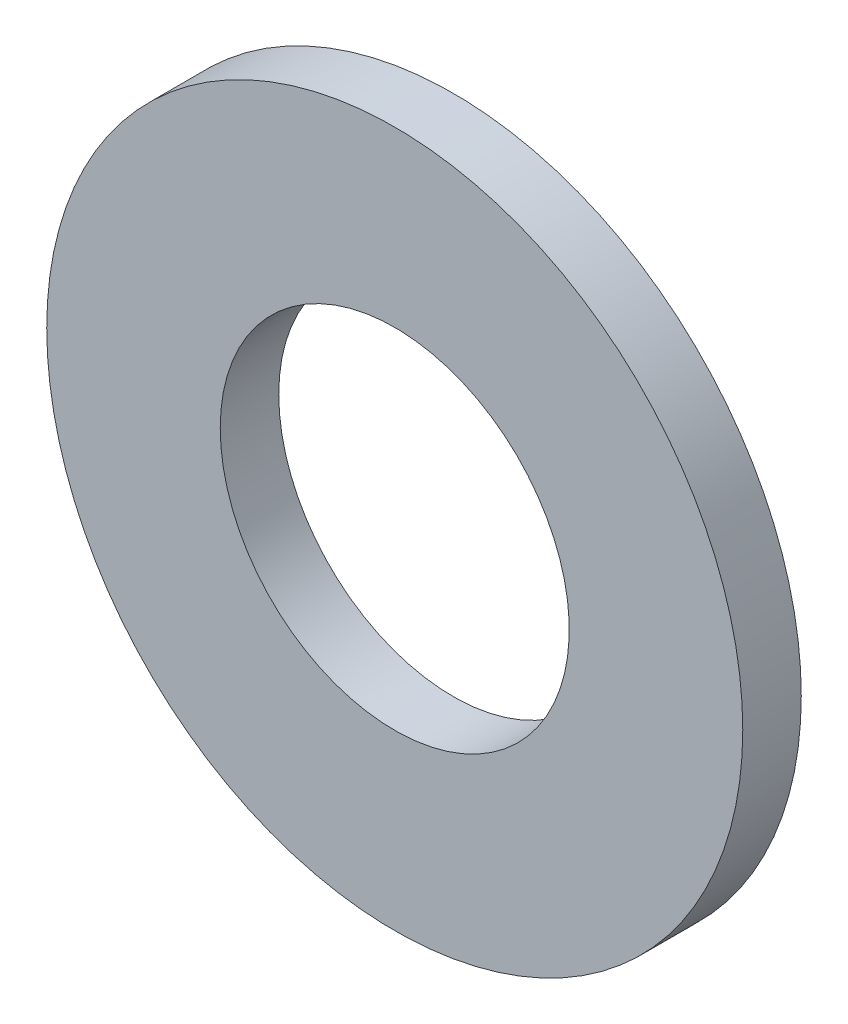
ISO-10303-21;
HEADER;
FILE_DESCRIPTION(('STEP AP214'),'2;1');
FILE_NAME('part.step','',(''),(''),'','','');
FILE_SCHEMA(('AUTOMOTIVE_DESIGN { 1 0 10303 214 1 1 1 1 }'));
ENDSEC;
DATA;
#1=APPLICATION_CONTEXT('core data for automotive mechanical design processes');
#2=APPLICATION_PROTOCOL_DEFINITION('international standard','automotive_design',2000,#1);
#3=PRODUCT_CONTEXT('',#1,'mechanical');
#4=PRODUCT('Part','Part','',(#3));
#5=PRODUCT_RELATED_PRODUCT_CATEGORY('part','',(#4));
#6=PRODUCT_DEFINITION_FORMATION('','',#4);
#7=PRODUCT_DEFINITION_CONTEXT('part definition',#1,'design');
#8=PRODUCT_DEFINITION('design','',#6,#7);
#9=PRODUCT_DEFINITION_SHAPE('','',#8);
#10=(LENGTH_UNIT() NAMED_UNIT(*) SI_UNIT(.MILLI.,.METRE.));
#11=(NAMED_UNIT(*) PLANE_ANGLE_UNIT() SI_UNIT($,.RADIAN.));
#12=(NAMED_UNIT(*) SI_UNIT($,.STERADIAN.) SOLID_ANGLE_UNIT());
#13=UNCERTAINTY_MEASURE_WITH_UNIT(LENGTH_MEASURE(1.E-05),#10,'distance_accuracy_value','');
#14=(GEOMETRIC_REPRESENTATION_CONTEXT(3) GLOBAL_UNCERTAINTY_ASSIGNED_CONTEXT((#13)) GLOBAL_UNIT_ASSIGNED_CONTEXT((#10,
#11,#12)) REPRESENTATION_CONTEXT('',''));
#15=CARTESIAN_POINT('',(0.,0.,0.));
#16=DIRECTION('',(0.,0.,1.));
#17=DIRECTION('',(1.,0.,0.));
#18=AXIS2_PLACEMENT_3D('',#15,#16,#17);
#19=CARTESIAN_POINT('',(0.,0.,0.));
#20=DIRECTION('',(0.,0.,-1.));
#21=DIRECTION('',(-1.,0.,0.));
#22=AXIS2_PLACEMENT_3D('',#19,#20,#21);
#23=PLANE('',#22);
#24=CARTESIAN_POINT('',(0.,0.,0.));
#25=DIRECTION('',(0.,0.,-1.));
#26=DIRECTION('',(-1.,0.,0.));
#27=AXIS2_PLACEMENT_3D('',#24,#25,#26);
#28=CIRCLE('',#27,8.763);
#29=CARTESIAN_POINT('',(-8.763,0.,0.));
#30=VERTEX_POINT('',#29);
#31=EDGE_CURVE('E26',#30,#30,#28,.F.);
#32=ORIENTED_EDGE('',*,*,#31,.F.);
#33=EDGE_LOOP('',(#32));
#34=FACE_BOUND('',#33,.T.);
#35=CARTESIAN_POINT('',(0.,0.,0.));
#36=DIRECTION('',(0.,0.,-1.));
#37=DIRECTION('',(-1.,0.,0.));
#38=AXIS2_PLACEMENT_3D('',#35,#36,#37);
#39=CIRCLE('',#38,4.3942);
#40=CARTESIAN_POINT('',(-4.3942,0.,0.));
#41=VERTEX_POINT('',#40);
#42=EDGE_CURVE('E17',#41,#41,#39,.F.);
#43=ORIENTED_EDGE('',*,*,#42,.T.);
#44=EDGE_LOOP('',(#43));
#45=FACE_BOUND('',#44,.T.);
#46=ADVANCED_FACE('F14',(#34,#45),#23,.T.);
#47=CARTESIAN_POINT('',(0.,0.,1.4732));
#48=DIRECTION('',(0.,0.,-1.));
#49=DIRECTION('',(-1.,0.,0.));
#50=AXIS2_PLACEMENT_3D('',#47,#48,#49);
#51=CYLINDRICAL_SURFACE('',#50,4.3942);
#52=CARTESIAN_POINT('',(0.,0.,1.4732));
#53=DIRECTION('',(0.,0.,-1.));
#54=DIRECTION('',(-1.,0.,0.));
#55=AXIS2_PLACEMENT_3D('',#52,#53,#54);
#56=CIRCLE('',#55,4.3942);
#57=CARTESIAN_POINT('',(-4.3942,0.,1.4732));
#58=VERTEX_POINT('',#57);
#59=EDGE_CURVE('E21',#58,#58,#56,.F.);
#60=ORIENTED_EDGE('',*,*,#59,.T.);
#61=EDGE_LOOP('',(#60));
#62=FACE_BOUND('',#61,.T.);
#63=ORIENTED_EDGE('',*,*,#42,.F.);
#64=EDGE_LOOP('',(#63));
#65=FACE_BOUND('',#64,.T.);
#66=ADVANCED_FACE('F35',(#62,#65),#51,.F.);
#67=CARTESIAN_POINT('',(0.,0.,1.4732));
#68=DIRECTION('',(0.,0.,-1.));
#69=DIRECTION('',(-1.,0.,0.));
#70=AXIS2_PLACEMENT_3D('',#67,#68,#69);
#71=CYLINDRICAL_SURFACE('',#70,8.763);
#72=ORIENTED_EDGE('',*,*,#31,.T.);
#73=EDGE_LOOP('',(#72));
#74=FACE_BOUND('',#73,.T.);
#75=CARTESIAN_POINT('',(0.,0.,1.4732));
#76=DIRECTION('',(0.,0.,-1.));
#77=DIRECTION('',(-1.,0.,0.));
#78=AXIS2_PLACEMENT_3D('',#75,#76,#77);
#79=CIRCLE('',#78,8.763);
#80=CARTESIAN_POINT('',(-8.763,0.,1.4732));
#81=VERTEX_POINT('',#80);
#82=EDGE_CURVE('E10',#81,#81,#79,.T.);
#83=ORIENTED_EDGE('',*,*,#82,.T.);
#84=EDGE_LOOP('',(#83));
#85=FACE_BOUND('',#84,.T.);
#86=ADVANCED_FACE('F37',(#74,#85),#71,.T.);
#87=CARTESIAN_POINT('',(0.,0.,1.4732));
#88=DIRECTION('',(0.,0.,-1.));
#89=DIRECTION('',(-1.,0.,0.));
#90=AXIS2_PLACEMENT_3D('',#87,#88,#89);
#91=PLANE('',#90);
#92=ORIENTED_EDGE('',*,*,#82,.F.);
#93=EDGE_LOOP('',(#92));
#94=FACE_BOUND('',#93,.T.);
#95=ORIENTED_EDGE('',*,*,#59,.F.);
#96=EDGE_LOOP('',(#95));
#97=FACE_BOUND('',#96,.T.);
#98=ADVANCED_FACE('F44',(#94,#97),#91,.F.);
#99=CLOSED_SHELL('',(#46,#66,#86,#98));
#100=MANIFOLD_SOLID_BREP('B1',#99);
#101=ADVANCED_BREP_SHAPE_REPRESENTATION('',(#18,#100),#14);
#102=SHAPE_DEFINITION_REPRESENTATION(#9,#101);
ENDSEC;
END-ISO-10303-21;
